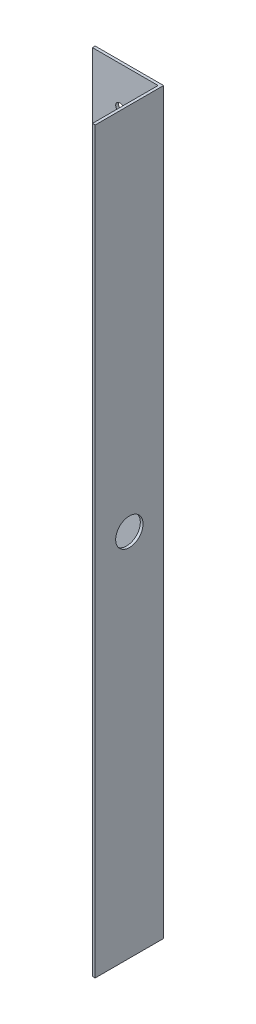
ISO-10303-21;
HEADER;
FILE_DESCRIPTION(('STEP AP214'),'2;1');
FILE_NAME('part.step','',(''),(''),'','','');
FILE_SCHEMA(('AUTOMOTIVE_DESIGN { 1 0 10303 214 1 1 1 1 }'));
ENDSEC;
DATA;
#1=APPLICATION_CONTEXT('core data for automotive mechanical design processes');
#2=APPLICATION_PROTOCOL_DEFINITION('international standard','automotive_design',2000,#1);
#3=PRODUCT_CONTEXT('',#1,'mechanical');
#4=PRODUCT('Part','Part','',(#3));
#5=PRODUCT_RELATED_PRODUCT_CATEGORY('part','',(#4));
#6=PRODUCT_DEFINITION_FORMATION('','',#4);
#7=PRODUCT_DEFINITION_CONTEXT('part definition',#1,'design');
#8=PRODUCT_DEFINITION('design','',#6,#7);
#9=PRODUCT_DEFINITION_SHAPE('','',#8);
#10=(LENGTH_UNIT() NAMED_UNIT(*) SI_UNIT(.MILLI.,.METRE.));
#11=(NAMED_UNIT(*) PLANE_ANGLE_UNIT() SI_UNIT($,.RADIAN.));
#12=(NAMED_UNIT(*) SI_UNIT($,.STERADIAN.) SOLID_ANGLE_UNIT());
#13=UNCERTAINTY_MEASURE_WITH_UNIT(LENGTH_MEASURE(1.E-05),#10,'distance_accuracy_value','');
#14=(GEOMETRIC_REPRESENTATION_CONTEXT(3) GLOBAL_UNCERTAINTY_ASSIGNED_CONTEXT((#13)) GLOBAL_UNIT_ASSIGNED_CONTEXT((#10,
#11,#12)) REPRESENTATION_CONTEXT('',''));
#15=CARTESIAN_POINT('',(0.,0.,0.));
#16=DIRECTION('',(0.,0.,1.));
#17=DIRECTION('',(1.,0.,0.));
#18=AXIS2_PLACEMENT_3D('',#15,#16,#17);
#19=CARTESIAN_POINT('',(0.,0.,1.));
#20=DIRECTION('',(0.,0.,1.));
#21=DIRECTION('',(1.,0.,0.));
#22=AXIS2_PLACEMENT_3D('',#19,#20,#21);
#23=PLANE('',#22);
#24=CARTESIAN_POINT('',(-43.4017250423012,12.4851945854484,1.));
#25=DIRECTION('',(0.,0.,1.));
#26=DIRECTION('',(1.,0.,0.));
#27=AXIS2_PLACEMENT_3D('',#24,#25,#26);
#28=CIRCLE('',#27,1.5);
#29=CARTESIAN_POINT('',(-41.9017250423012,12.4851945854484,1.));
#30=VERTEX_POINT('',#29);
#31=EDGE_CURVE('E97',#30,#30,#28,.T.);
#32=ORIENTED_EDGE('',*,*,#31,.F.);
#33=EDGE_LOOP('',(#32));
#34=FACE_BOUND('',#33,.T.);
#35=DIRECTION('',(0.,-1.,0.));
#36=VECTOR('',#35,1.);
#37=CARTESIAN_POINT('',(-53.4017250423012,26.4851945854484,1.));
#38=LINE('',#37,#36);
#39=CARTESIAN_POINT('',(-53.4017250423012,26.4851945854484,1.));
#40=VERTEX_POINT('',#39);
#41=CARTESIAN_POINT('',(-53.4017250423012,-243.514805414552,1.));
#42=VERTEX_POINT('',#41);
#43=EDGE_CURVE('E87',#40,#42,#38,.T.);
#44=ORIENTED_EDGE('',*,*,#43,.T.);
#45=DIRECTION('',(1.,0.,0.));
#46=VECTOR('',#45,1.);
#47=CARTESIAN_POINT('',(-53.4017250423012,-243.514805414552,1.));
#48=LINE('',#47,#46);
#49=CARTESIAN_POINT('',(-29.4017250423012,-243.514805414552,1.));
#50=VERTEX_POINT('',#49);
#51=EDGE_CURVE('E81',#42,#50,#48,.T.);
#52=ORIENTED_EDGE('',*,*,#51,.T.);
#53=DIRECTION('',(0.,1.,0.));
#54=VECTOR('',#53,1.);
#55=CARTESIAN_POINT('',(-29.4017250423012,26.4851945854484,1.));
#56=LINE('',#55,#54);
#57=CARTESIAN_POINT('',(-29.4017250423012,26.4851945854484,1.));
#58=VERTEX_POINT('',#57);
#59=EDGE_CURVE('E70',#50,#58,#56,.T.);
#60=ORIENTED_EDGE('',*,*,#59,.T.);
#61=DIRECTION('',(-1.,0.,0.));
#62=VECTOR('',#61,1.);
#63=CARTESIAN_POINT('',(-53.4017250423012,26.4851945854484,1.));
#64=LINE('',#63,#62);
#65=EDGE_CURVE('E50',#58,#40,#64,.T.);
#66=ORIENTED_EDGE('',*,*,#65,.T.);
#67=EDGE_LOOP('',(#44,#52,#60,#66));
#68=FACE_BOUND('',#67,.T.);
#69=CARTESIAN_POINT('',(-43.4017250423012,-229.514805414552,1.));
#70=DIRECTION('',(0.,0.,1.));
#71=DIRECTION('',(1.,0.,0.));
#72=AXIS2_PLACEMENT_3D('',#69,#70,#71);
#73=CIRCLE('',#72,1.5);
#74=CARTESIAN_POINT('',(-41.9017250423012,-229.514805414552,1.));
#75=VERTEX_POINT('',#74);
#76=EDGE_CURVE('E108',#75,#75,#73,.T.);
#77=ORIENTED_EDGE('',*,*,#76,.F.);
#78=EDGE_LOOP('',(#77));
#79=FACE_BOUND('',#78,.T.);
#80=ADVANCED_FACE('F33',(#34,#68,#79),#23,.T.);
#81=CARTESIAN_POINT('',(0.,0.,0.));
#82=DIRECTION('',(0.,0.,1.));
#83=DIRECTION('',(1.,0.,0.));
#84=AXIS2_PLACEMENT_3D('',#81,#82,#83);
#85=PLANE('',#84);
#86=DIRECTION('',(0.,-1.,0.));
#87=VECTOR('',#86,1.);
#88=CARTESIAN_POINT('',(-53.4017250423012,26.4851945854484,0.));
#89=LINE('',#88,#87);
#90=CARTESIAN_POINT('',(-53.4017250423012,26.4851945854484,0.));
#91=VERTEX_POINT('',#90);
#92=CARTESIAN_POINT('',(-53.4017250423012,-243.514805414552,0.));
#93=VERTEX_POINT('',#92);
#94=EDGE_CURVE('E95',#91,#93,#89,.T.);
#95=ORIENTED_EDGE('',*,*,#94,.F.);
#96=DIRECTION('',(-1.,0.,0.));
#97=VECTOR('',#96,1.);
#98=CARTESIAN_POINT('',(-53.4017250423012,26.4851945854484,0.));
#99=LINE('',#98,#97);
#100=CARTESIAN_POINT('',(-28.4017250423012,26.4851945854484,0.));
#101=VERTEX_POINT('',#100);
#102=EDGE_CURVE('E93',#101,#91,#99,.T.);
#103=ORIENTED_EDGE('',*,*,#102,.F.);
#104=DIRECTION('',(0.,1.,0.));
#105=VECTOR('',#104,1.);
#106=CARTESIAN_POINT('',(-28.4017250423012,26.4851945854484,0.));
#107=LINE('',#106,#105);
#108=CARTESIAN_POINT('',(-28.4017250423012,-243.514805414552,0.));
#109=VERTEX_POINT('',#108);
#110=EDGE_CURVE('E125',#109,#101,#107,.T.);
#111=ORIENTED_EDGE('',*,*,#110,.F.);
#112=DIRECTION('',(1.,0.,0.));
#113=VECTOR('',#112,1.);
#114=CARTESIAN_POINT('',(-53.4017250423012,-243.514805414552,0.));
#115=LINE('',#114,#113);
#116=EDGE_CURVE('E63',#93,#109,#115,.T.);
#117=ORIENTED_EDGE('',*,*,#116,.F.);
#118=EDGE_LOOP('',(#95,#103,#111,#117));
#119=FACE_BOUND('',#118,.T.);
#120=CARTESIAN_POINT('',(-43.4017250423012,12.4851945854484,0.));
#121=DIRECTION('',(0.,0.,1.));
#122=DIRECTION('',(1.,0.,0.));
#123=AXIS2_PLACEMENT_3D('',#120,#121,#122);
#124=CIRCLE('',#123,1.5);
#125=CARTESIAN_POINT('',(-41.9017250423012,12.4851945854484,0.));
#126=VERTEX_POINT('',#125);
#127=EDGE_CURVE('E101',#126,#126,#124,.T.);
#128=ORIENTED_EDGE('',*,*,#127,.T.);
#129=EDGE_LOOP('',(#128));
#130=FACE_BOUND('',#129,.T.);
#131=CARTESIAN_POINT('',(-43.4017250423012,-229.514805414552,0.));
#132=DIRECTION('',(0.,0.,1.));
#133=DIRECTION('',(1.,0.,0.));
#134=AXIS2_PLACEMENT_3D('',#131,#132,#133);
#135=CIRCLE('',#134,1.5);
#136=CARTESIAN_POINT('',(-41.9017250423012,-229.514805414552,0.));
#137=VERTEX_POINT('',#136);
#138=EDGE_CURVE('E110',#137,#137,#135,.T.);
#139=ORIENTED_EDGE('',*,*,#138,.T.);
#140=EDGE_LOOP('',(#139));
#141=FACE_BOUND('',#140,.T.);
#142=ADVANCED_FACE('F184',(#119,#130,#141),#85,.F.);
#143=CARTESIAN_POINT('',(-53.4017250423012,26.4851945854484,1.));
#144=DIRECTION('',(1.,0.,0.));
#145=DIRECTION('',(0.,1.,0.));
#146=AXIS2_PLACEMENT_3D('',#143,#144,#145);
#147=PLANE('',#146);
#148=ORIENTED_EDGE('',*,*,#94,.T.);
#149=DIRECTION('',(0.,0.,-1.));
#150=VECTOR('',#149,1.);
#151=CARTESIAN_POINT('',(-53.4017250423012,-243.514805414552,1.));
#152=LINE('',#151,#150);
#153=EDGE_CURVE('E11',#42,#93,#152,.T.);
#154=ORIENTED_EDGE('',*,*,#153,.F.);
#155=ORIENTED_EDGE('',*,*,#43,.F.);
#156=DIRECTION('',(0.,0.,-1.));
#157=VECTOR('',#156,1.);
#158=CARTESIAN_POINT('',(-53.4017250423012,26.4851945854484,1.));
#159=LINE('',#158,#157);
#160=EDGE_CURVE('E42',#40,#91,#159,.T.);
#161=ORIENTED_EDGE('',*,*,#160,.T.);
#162=EDGE_LOOP('',(#148,#154,#155,#161));
#163=FACE_BOUND('',#162,.T.);
#164=ADVANCED_FACE('F35',(#163),#147,.F.);
#165=CARTESIAN_POINT('',(-53.4017250423012,-243.514805414552,1.));
#166=DIRECTION('',(0.,1.,0.));
#167=DIRECTION('',(0.,0.,1.));
#168=AXIS2_PLACEMENT_3D('',#165,#166,#167);
#169=PLANE('',#168);
#170=ORIENTED_EDGE('',*,*,#116,.T.);
#171=DIRECTION('',(0.,0.,-1.));
#172=VECTOR('',#171,1.);
#173=CARTESIAN_POINT('',(-28.4017250423012,-243.514805414552,25.));
#174=LINE('',#173,#172);
#175=CARTESIAN_POINT('',(-28.4017250423012,-243.514805414552,25.));
#176=VERTEX_POINT('',#175);
#177=EDGE_CURVE('E116',#176,#109,#174,.T.);
#178=ORIENTED_EDGE('',*,*,#177,.F.);
#179=DIRECTION('',(1.,0.,0.));
#180=VECTOR('',#179,1.);
#181=CARTESIAN_POINT('',(-29.4017250423012,-243.514805414552,25.));
#182=LINE('',#181,#180);
#183=CARTESIAN_POINT('',(-29.4017250423012,-243.514805414552,25.));
#184=VERTEX_POINT('',#183);
#185=EDGE_CURVE('E134',#184,#176,#182,.T.);
#186=ORIENTED_EDGE('',*,*,#185,.F.);
#187=DIRECTION('',(0.,0.,-1.));
#188=VECTOR('',#187,1.);
#189=CARTESIAN_POINT('',(-29.4017250423012,-243.514805414552,25.));
#190=LINE('',#189,#188);
#191=EDGE_CURVE('E86',#184,#50,#190,.T.);
#192=ORIENTED_EDGE('',*,*,#191,.T.);
#193=ORIENTED_EDGE('',*,*,#51,.F.);
#194=ORIENTED_EDGE('',*,*,#153,.T.);
#195=EDGE_LOOP('',(#170,#178,#186,#192,#193,#194));
#196=FACE_BOUND('',#195,.T.);
#197=ADVANCED_FACE('F82',(#196),#169,.F.);
#198=CARTESIAN_POINT('',(-53.4017250423012,26.4851945854484,1.));
#199=DIRECTION('',(0.,-1.,0.));
#200=DIRECTION('',(0.,0.,-1.));
#201=AXIS2_PLACEMENT_3D('',#198,#199,#200);
#202=PLANE('',#201);
#203=ORIENTED_EDGE('',*,*,#102,.T.);
#204=ORIENTED_EDGE('',*,*,#160,.F.);
#205=ORIENTED_EDGE('',*,*,#65,.F.);
#206=DIRECTION('',(0.,0.,-1.));
#207=VECTOR('',#206,1.);
#208=CARTESIAN_POINT('',(-29.4017250423012,26.4851945854484,25.));
#209=LINE('',#208,#207);
#210=CARTESIAN_POINT('',(-29.4017250423012,26.4851945854484,25.));
#211=VERTEX_POINT('',#210);
#212=EDGE_CURVE('E122',#211,#58,#209,.T.);
#213=ORIENTED_EDGE('',*,*,#212,.F.);
#214=DIRECTION('',(-1.,0.,0.));
#215=VECTOR('',#214,1.);
#216=CARTESIAN_POINT('',(-29.4017250423012,26.4851945854484,25.));
#217=LINE('',#216,#215);
#218=CARTESIAN_POINT('',(-28.4017250423012,26.4851945854484,25.));
#219=VERTEX_POINT('',#218);
#220=EDGE_CURVE('E124',#219,#211,#217,.T.);
#221=ORIENTED_EDGE('',*,*,#220,.F.);
#222=DIRECTION('',(0.,0.,-1.));
#223=VECTOR('',#222,1.);
#224=CARTESIAN_POINT('',(-28.4017250423012,26.4851945854484,25.));
#225=LINE('',#224,#223);
#226=EDGE_CURVE('E119',#219,#101,#225,.T.);
#227=ORIENTED_EDGE('',*,*,#226,.T.);
#228=EDGE_LOOP('',(#203,#204,#205,#213,#221,#227));
#229=FACE_BOUND('',#228,.T.);
#230=ADVANCED_FACE('F165',(#229),#202,.F.);
#231=CARTESIAN_POINT('',(-43.4017250423012,12.4851945854484,1.));
#232=DIRECTION('',(0.,0.,-1.));
#233=DIRECTION('',(-1.,0.,0.));
#234=AXIS2_PLACEMENT_3D('',#231,#232,#233);
#235=CYLINDRICAL_SURFACE('',#234,1.5);
#236=ORIENTED_EDGE('',*,*,#31,.T.);
#237=EDGE_LOOP('',(#236));
#238=FACE_BOUND('',#237,.T.);
#239=ORIENTED_EDGE('',*,*,#127,.F.);
#240=EDGE_LOOP('',(#239));
#241=FACE_BOUND('',#240,.T.);
#242=ADVANCED_FACE('F180',(#238,#241),#235,.F.);
#243=CARTESIAN_POINT('',(-43.4017250423012,-229.514805414552,1.));
#244=DIRECTION('',(0.,0.,-1.));
#245=DIRECTION('',(-1.,0.,0.));
#246=AXIS2_PLACEMENT_3D('',#243,#244,#245);
#247=CYLINDRICAL_SURFACE('',#246,1.5);
#248=ORIENTED_EDGE('',*,*,#76,.T.);
#249=EDGE_LOOP('',(#248));
#250=FACE_BOUND('',#249,.T.);
#251=ORIENTED_EDGE('',*,*,#138,.F.);
#252=EDGE_LOOP('',(#251));
#253=FACE_BOUND('',#252,.T.);
#254=ADVANCED_FACE('F174',(#250,#253),#247,.F.);
#255=CARTESIAN_POINT('',(-29.4017250423012,26.4851945854484,25.));
#256=DIRECTION('',(1.,0.,0.));
#257=DIRECTION('',(0.,0.,-1.));
#258=AXIS2_PLACEMENT_3D('',#255,#256,#257);
#259=PLANE('',#258);
#260=CARTESIAN_POINT('',(-29.4017250423012,-108.514805414552,12.5));
#261=DIRECTION('',(1.,0.,0.));
#262=DIRECTION('',(0.,1.,0.));
#263=AXIS2_PLACEMENT_3D('',#260,#261,#262);
#264=CIRCLE('',#263,5.);
#265=CARTESIAN_POINT('',(-29.4017250423012,-103.514805414552,12.5));
#266=VERTEX_POINT('',#265);
#267=EDGE_CURVE('E129',#266,#266,#264,.T.);
#268=ORIENTED_EDGE('',*,*,#267,.T.);
#269=EDGE_LOOP('',(#268));
#270=FACE_BOUND('',#269,.T.);
#271=ORIENTED_EDGE('',*,*,#59,.F.);
#272=ORIENTED_EDGE('',*,*,#191,.F.);
#273=DIRECTION('',(0.,-1.,0.));
#274=VECTOR('',#273,1.);
#275=CARTESIAN_POINT('',(-29.4017250423012,26.4851945854484,25.));
#276=LINE('',#275,#274);
#277=EDGE_CURVE('E128',#211,#184,#276,.T.);
#278=ORIENTED_EDGE('',*,*,#277,.F.);
#279=ORIENTED_EDGE('',*,*,#212,.T.);
#280=EDGE_LOOP('',(#271,#272,#278,#279));
#281=FACE_BOUND('',#280,.T.);
#282=ADVANCED_FACE('F145',(#270,#281),#259,.F.);
#283=CARTESIAN_POINT('',(-28.4017250423012,26.4851945854484,25.));
#284=DIRECTION('',(-1.,0.,0.));
#285=DIRECTION('',(0.,-1.,0.));
#286=AXIS2_PLACEMENT_3D('',#283,#284,#285);
#287=PLANE('',#286);
#288=CARTESIAN_POINT('',(-28.4017250423012,-108.514805414552,12.5));
#289=DIRECTION('',(1.,0.,0.));
#290=DIRECTION('',(0.,1.,0.));
#291=AXIS2_PLACEMENT_3D('',#288,#289,#290);
#292=CIRCLE('',#291,5.);
#293=CARTESIAN_POINT('',(-28.4017250423012,-103.514805414552,12.5));
#294=VERTEX_POINT('',#293);
#295=EDGE_CURVE('E139',#294,#294,#292,.T.);
#296=ORIENTED_EDGE('',*,*,#295,.F.);
#297=EDGE_LOOP('',(#296));
#298=FACE_BOUND('',#297,.T.);
#299=ORIENTED_EDGE('',*,*,#110,.T.);
#300=ORIENTED_EDGE('',*,*,#226,.F.);
#301=DIRECTION('',(0.,1.,0.));
#302=VECTOR('',#301,1.);
#303=CARTESIAN_POINT('',(-28.4017250423012,26.4851945854484,25.));
#304=LINE('',#303,#302);
#305=EDGE_CURVE('E131',#176,#219,#304,.T.);
#306=ORIENTED_EDGE('',*,*,#305,.F.);
#307=ORIENTED_EDGE('',*,*,#177,.T.);
#308=EDGE_LOOP('',(#299,#300,#306,#307));
#309=FACE_BOUND('',#308,.T.);
#310=ADVANCED_FACE('F154',(#298,#309),#287,.F.);
#311=CARTESIAN_POINT('',(0.,0.,25.));
#312=DIRECTION('',(0.,0.,1.));
#313=DIRECTION('',(1.,0.,0.));
#314=AXIS2_PLACEMENT_3D('',#311,#312,#313);
#315=PLANE('',#314);
#316=ORIENTED_EDGE('',*,*,#277,.T.);
#317=ORIENTED_EDGE('',*,*,#185,.T.);
#318=ORIENTED_EDGE('',*,*,#305,.T.);
#319=ORIENTED_EDGE('',*,*,#220,.T.);
#320=EDGE_LOOP('',(#316,#317,#318,#319));
#321=FACE_BOUND('',#320,.T.);
#322=ADVANCED_FACE('F150',(#321),#315,.T.);
#323=CARTESIAN_POINT('',(-29.4017250423012,-108.514805414552,12.5));
#324=DIRECTION('',(1.,0.,0.));
#325=DIRECTION('',(0.,1.,0.));
#326=AXIS2_PLACEMENT_3D('',#323,#324,#325);
#327=CYLINDRICAL_SURFACE('',#326,5.);
#328=ORIENTED_EDGE('',*,*,#267,.F.);
#329=EDGE_LOOP('',(#328));
#330=FACE_BOUND('',#329,.T.);
#331=ORIENTED_EDGE('',*,*,#295,.T.);
#332=EDGE_LOOP('',(#331));
#333=FACE_BOUND('',#332,.T.);
#334=ADVANCED_FACE('F147',(#330,#333),#327,.F.);
#335=CLOSED_SHELL('',(#80,#142,#164,#197,#230,#242,#254,#282,#310,#322,#334));
#336=MANIFOLD_SOLID_BREP('B2',#335);
#337=ADVANCED_BREP_SHAPE_REPRESENTATION('',(#18,#336),#14);
#338=SHAPE_DEFINITION_REPRESENTATION(#9,#337);
ENDSEC;
END-ISO-10303-21;
